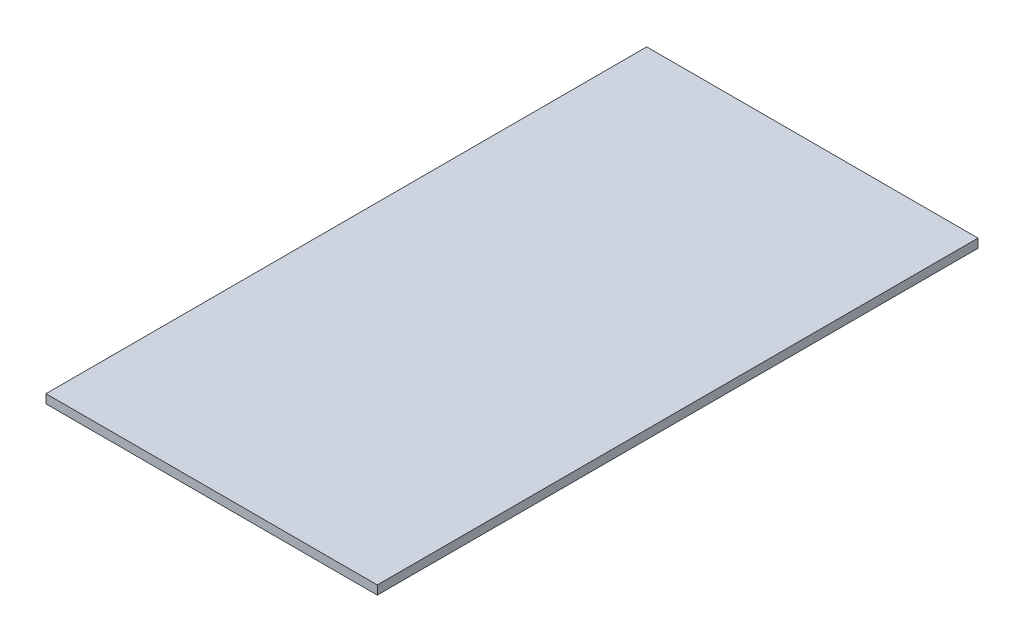
ISO-10303-21;
HEADER;
FILE_DESCRIPTION(('STEP AP214'),'2;1');
FILE_NAME('part.step','',(''),(''),'','','');
FILE_SCHEMA(('AUTOMOTIVE_DESIGN { 1 0 10303 214 1 1 1 1 }'));
ENDSEC;
DATA;
#1=APPLICATION_CONTEXT('core data for automotive mechanical design processes');
#2=APPLICATION_PROTOCOL_DEFINITION('international standard','automotive_design',2000,#1);
#3=PRODUCT_CONTEXT('',#1,'mechanical');
#4=PRODUCT('Part','Part','',(#3));
#5=PRODUCT_RELATED_PRODUCT_CATEGORY('part','',(#4));
#6=PRODUCT_DEFINITION_FORMATION('','',#4);
#7=PRODUCT_DEFINITION_CONTEXT('part definition',#1,'design');
#8=PRODUCT_DEFINITION('design','',#6,#7);
#9=PRODUCT_DEFINITION_SHAPE('','',#8);
#10=(LENGTH_UNIT() NAMED_UNIT(*) SI_UNIT(.MILLI.,.METRE.));
#11=(NAMED_UNIT(*) PLANE_ANGLE_UNIT() SI_UNIT($,.RADIAN.));
#12=(NAMED_UNIT(*) SI_UNIT($,.STERADIAN.) SOLID_ANGLE_UNIT());
#13=UNCERTAINTY_MEASURE_WITH_UNIT(LENGTH_MEASURE(1.E-05),#10,'distance_accuracy_value','');
#14=(GEOMETRIC_REPRESENTATION_CONTEXT(3) GLOBAL_UNCERTAINTY_ASSIGNED_CONTEXT((#13)) GLOBAL_UNIT_ASSIGNED_CONTEXT((#10,
#11,#12)) REPRESENTATION_CONTEXT('',''));
#15=CARTESIAN_POINT('',(0.,0.,0.));
#16=DIRECTION('',(0.,0.,1.));
#17=DIRECTION('',(1.,0.,0.));
#18=AXIS2_PLACEMENT_3D('',#15,#16,#17);
#19=CARTESIAN_POINT('',(-75.,2.,136.));
#20=DIRECTION('',(-1.,0.,0.));
#21=DIRECTION('',(0.,0.,1.));
#22=AXIS2_PLACEMENT_3D('',#19,#20,#21);
#23=PLANE('',#22);
#24=DIRECTION('',(0.,0.,-1.));
#25=VECTOR('',#24,1.);
#26=CARTESIAN_POINT('',(-75.,0.,136.));
#27=LINE('',#26,#25);
#28=CARTESIAN_POINT('',(-75.,0.,136.));
#29=VERTEX_POINT('',#28);
#30=CARTESIAN_POINT('',(-75.,0.,0.));
#31=VERTEX_POINT('',#30);
#32=EDGE_CURVE('E85',#29,#31,#27,.T.);
#33=ORIENTED_EDGE('',*,*,#32,.F.);
#34=DIRECTION('',(0.,-1.,0.));
#35=VECTOR('',#34,1.);
#36=CARTESIAN_POINT('',(-75.,2.,136.));
#37=LINE('',#36,#35);
#38=CARTESIAN_POINT('',(-75.,2.,136.));
#39=VERTEX_POINT('',#38);
#40=EDGE_CURVE('E34',#39,#29,#37,.T.);
#41=ORIENTED_EDGE('',*,*,#40,.F.);
#42=DIRECTION('',(0.,0.,-1.));
#43=VECTOR('',#42,1.);
#44=CARTESIAN_POINT('',(-75.,2.,136.));
#45=LINE('',#44,#43);
#46=CARTESIAN_POINT('',(-75.,2.,0.));
#47=VERTEX_POINT('',#46);
#48=EDGE_CURVE('E73',#39,#47,#45,.T.);
#49=ORIENTED_EDGE('',*,*,#48,.T.);
#50=DIRECTION('',(0.,-1.,0.));
#51=VECTOR('',#50,1.);
#52=CARTESIAN_POINT('',(-75.,2.,0.));
#53=LINE('',#52,#51);
#54=EDGE_CURVE('E11',#47,#31,#53,.T.);
#55=ORIENTED_EDGE('',*,*,#54,.T.);
#56=EDGE_LOOP('',(#33,#41,#49,#55));
#57=FACE_BOUND('',#56,.T.);
#58=ADVANCED_FACE('F18',(#57),#23,.T.);
#59=CARTESIAN_POINT('',(-75.,2.,0.));
#60=DIRECTION('',(0.,0.,-1.));
#61=DIRECTION('',(-1.,0.,0.));
#62=AXIS2_PLACEMENT_3D('',#59,#60,#61);
#63=PLANE('',#62);
#64=DIRECTION('',(1.,0.,0.));
#65=VECTOR('',#64,1.);
#66=CARTESIAN_POINT('',(-75.,0.,0.));
#67=LINE('',#66,#65);
#68=CARTESIAN_POINT('',(0.,0.,0.));
#69=VERTEX_POINT('',#68);
#70=EDGE_CURVE('E82',#31,#69,#67,.T.);
#71=ORIENTED_EDGE('',*,*,#70,.F.);
#72=ORIENTED_EDGE('',*,*,#54,.F.);
#73=DIRECTION('',(1.,0.,0.));
#74=VECTOR('',#73,1.);
#75=CARTESIAN_POINT('',(-75.,2.,0.));
#76=LINE('',#75,#74);
#77=CARTESIAN_POINT('',(0.,2.,0.));
#78=VERTEX_POINT('',#77);
#79=EDGE_CURVE('E69',#47,#78,#76,.T.);
#80=ORIENTED_EDGE('',*,*,#79,.T.);
#81=DIRECTION('',(0.,-1.,0.));
#82=VECTOR('',#81,1.);
#83=CARTESIAN_POINT('',(0.,2.,0.));
#84=LINE('',#83,#82);
#85=EDGE_CURVE('E26',#78,#69,#84,.T.);
#86=ORIENTED_EDGE('',*,*,#85,.T.);
#87=EDGE_LOOP('',(#71,#72,#80,#86));
#88=FACE_BOUND('',#87,.T.);
#89=ADVANCED_FACE('F70',(#88),#63,.T.);
#90=CARTESIAN_POINT('',(0.,2.,0.));
#91=DIRECTION('',(1.,0.,0.));
#92=DIRECTION('',(0.,0.,-1.));
#93=AXIS2_PLACEMENT_3D('',#90,#91,#92);
#94=PLANE('',#93);
#95=DIRECTION('',(0.,0.,1.));
#96=VECTOR('',#95,1.);
#97=CARTESIAN_POINT('',(0.,0.,0.));
#98=LINE('',#97,#96);
#99=CARTESIAN_POINT('',(0.,0.,136.));
#100=VERTEX_POINT('',#99);
#101=EDGE_CURVE('E67',#69,#100,#98,.T.);
#102=ORIENTED_EDGE('',*,*,#101,.F.);
#103=ORIENTED_EDGE('',*,*,#85,.F.);
#104=DIRECTION('',(0.,0.,1.));
#105=VECTOR('',#104,1.);
#106=CARTESIAN_POINT('',(0.,2.,0.));
#107=LINE('',#106,#105);
#108=CARTESIAN_POINT('',(0.,2.,136.));
#109=VERTEX_POINT('',#108);
#110=EDGE_CURVE('E64',#78,#109,#107,.T.);
#111=ORIENTED_EDGE('',*,*,#110,.T.);
#112=DIRECTION('',(0.,-1.,0.));
#113=VECTOR('',#112,1.);
#114=CARTESIAN_POINT('',(0.,2.,136.));
#115=LINE('',#114,#113);
#116=EDGE_CURVE('E50',#109,#100,#115,.T.);
#117=ORIENTED_EDGE('',*,*,#116,.T.);
#118=EDGE_LOOP('',(#102,#103,#111,#117));
#119=FACE_BOUND('',#118,.T.);
#120=ADVANCED_FACE('F62',(#119),#94,.T.);
#121=CARTESIAN_POINT('',(0.,2.,136.));
#122=DIRECTION('',(0.,0.,1.));
#123=DIRECTION('',(1.,0.,0.));
#124=AXIS2_PLACEMENT_3D('',#121,#122,#123);
#125=PLANE('',#124);
#126=DIRECTION('',(-1.,0.,0.));
#127=VECTOR('',#126,1.);
#128=CARTESIAN_POINT('',(0.,0.,136.));
#129=LINE('',#128,#127);
#130=EDGE_CURVE('E81',#100,#29,#129,.T.);
#131=ORIENTED_EDGE('',*,*,#130,.F.);
#132=ORIENTED_EDGE('',*,*,#116,.F.);
#133=DIRECTION('',(-1.,0.,0.));
#134=VECTOR('',#133,1.);
#135=CARTESIAN_POINT('',(0.,2.,136.));
#136=LINE('',#135,#134);
#137=EDGE_CURVE('E76',#109,#39,#136,.T.);
#138=ORIENTED_EDGE('',*,*,#137,.T.);
#139=ORIENTED_EDGE('',*,*,#40,.T.);
#140=EDGE_LOOP('',(#131,#132,#138,#139));
#141=FACE_BOUND('',#140,.T.);
#142=ADVANCED_FACE('F106',(#141),#125,.T.);
#143=CARTESIAN_POINT('',(-75.,2.,0.));
#144=DIRECTION('',(0.,-1.,0.));
#145=DIRECTION('',(0.,0.,-1.));
#146=AXIS2_PLACEMENT_3D('',#143,#144,#145);
#147=PLANE('',#146);
#148=ORIENTED_EDGE('',*,*,#48,.F.);
#149=ORIENTED_EDGE('',*,*,#137,.F.);
#150=ORIENTED_EDGE('',*,*,#110,.F.);
#151=ORIENTED_EDGE('',*,*,#79,.F.);
#152=EDGE_LOOP('',(#148,#149,#150,#151));
#153=FACE_BOUND('',#152,.T.);
#154=ADVANCED_FACE('F75',(#153),#147,.F.);
#155=CARTESIAN_POINT('',(-75.,0.,0.));
#156=DIRECTION('',(0.,-1.,0.));
#157=DIRECTION('',(0.,0.,-1.));
#158=AXIS2_PLACEMENT_3D('',#155,#156,#157);
#159=PLANE('',#158);
#160=ORIENTED_EDGE('',*,*,#32,.T.);
#161=ORIENTED_EDGE('',*,*,#70,.T.);
#162=ORIENTED_EDGE('',*,*,#101,.T.);
#163=ORIENTED_EDGE('',*,*,#130,.T.);
#164=EDGE_LOOP('',(#160,#161,#162,#163));
#165=FACE_BOUND('',#164,.T.);
#166=ADVANCED_FACE('F97',(#165),#159,.T.);
#167=CLOSED_SHELL('',(#58,#89,#120,#142,#154,#166));
#168=MANIFOLD_SOLID_BREP('B1',#167);
#169=ADVANCED_BREP_SHAPE_REPRESENTATION('',(#18,#168),#14);
#170=SHAPE_DEFINITION_REPRESENTATION(#9,#169);
ENDSEC;
END-ISO-10303-21;
